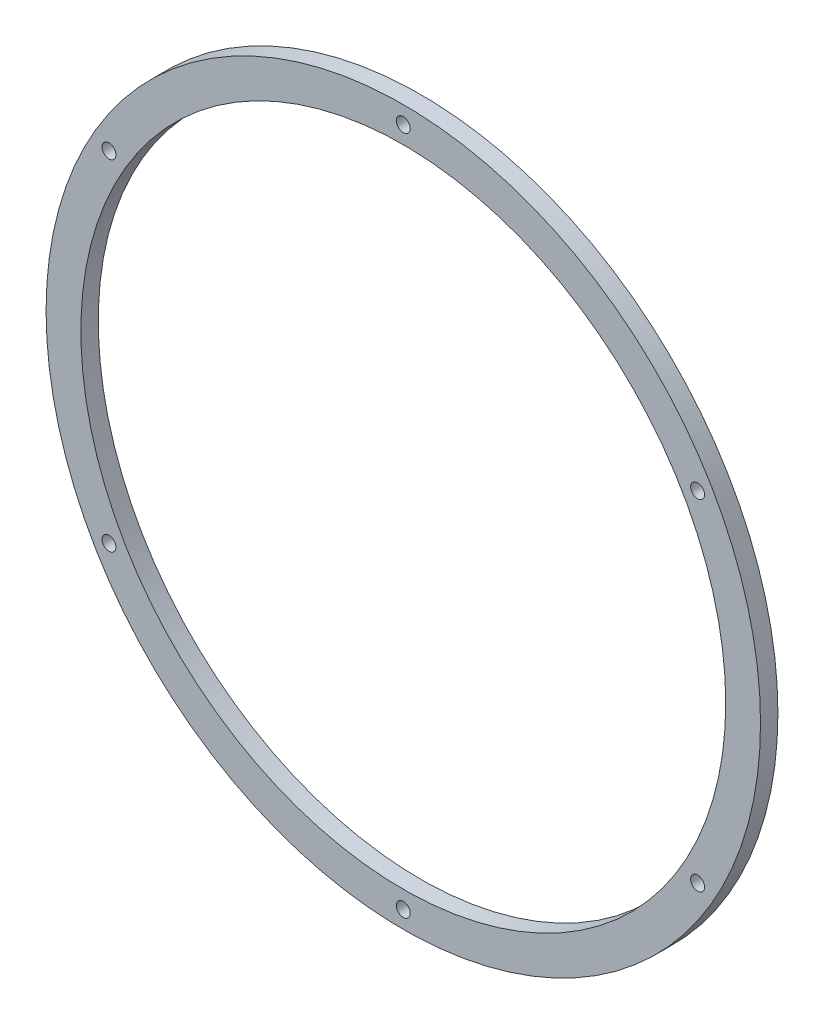
ISO-10303-21;
HEADER;
FILE_DESCRIPTION(('STEP AP214'),'2;1');
FILE_NAME('part.step','',(''),(''),'','','');
FILE_SCHEMA(('AUTOMOTIVE_DESIGN { 1 0 10303 214 1 1 1 1 }'));
ENDSEC;
DATA;
#1=APPLICATION_CONTEXT('core data for automotive mechanical design processes');
#2=APPLICATION_PROTOCOL_DEFINITION('international standard','automotive_design',2000,#1);
#3=PRODUCT_CONTEXT('',#1,'mechanical');
#4=PRODUCT('Part','Part','',(#3));
#5=PRODUCT_RELATED_PRODUCT_CATEGORY('part','',(#4));
#6=PRODUCT_DEFINITION_FORMATION('','',#4);
#7=PRODUCT_DEFINITION_CONTEXT('part definition',#1,'design');
#8=PRODUCT_DEFINITION('design','',#6,#7);
#9=PRODUCT_DEFINITION_SHAPE('','',#8);
#10=(LENGTH_UNIT() NAMED_UNIT(*) SI_UNIT(.MILLI.,.METRE.));
#11=(NAMED_UNIT(*) PLANE_ANGLE_UNIT() SI_UNIT($,.RADIAN.));
#12=(NAMED_UNIT(*) SI_UNIT($,.STERADIAN.) SOLID_ANGLE_UNIT());
#13=UNCERTAINTY_MEASURE_WITH_UNIT(LENGTH_MEASURE(1.E-05),#10,'distance_accuracy_value','');
#14=(GEOMETRIC_REPRESENTATION_CONTEXT(3) GLOBAL_UNCERTAINTY_ASSIGNED_CONTEXT((#13)) GLOBAL_UNIT_ASSIGNED_CONTEXT((#10,
#11,#12)) REPRESENTATION_CONTEXT('',''));
#15=CARTESIAN_POINT('',(0.,0.,0.));
#16=DIRECTION('',(0.,0.,1.));
#17=DIRECTION('',(1.,0.,0.));
#18=AXIS2_PLACEMENT_3D('',#15,#16,#17);
#19=CARTESIAN_POINT('',(0.,0.,5.));
#20=DIRECTION('',(0.,0.,1.));
#21=DIRECTION('',(1.,0.,0.));
#22=AXIS2_PLACEMENT_3D('',#19,#20,#21);
#23=PLANE('',#22);
#24=CARTESIAN_POINT('',(-169.221363899478,97.700000000002,5.));
#25=DIRECTION('',(0.,0.,1.));
#26=DIRECTION('',(0.50000000000001,0.866025403784433,0.));
#27=AXIS2_PLACEMENT_3D('',#24,#25,#26);
#28=CIRCLE('',#27,4.);
#29=CARTESIAN_POINT('',(-167.221363899478,101.16410161514,5.));
#30=VERTEX_POINT('',#29);
#31=EDGE_CURVE('E68',#30,#30,#28,.T.);
#32=ORIENTED_EDGE('',*,*,#31,.F.);
#33=EDGE_LOOP('',(#32));
#34=FACE_BOUND('',#33,.T.);
#35=CARTESIAN_POINT('',(-169.22136389948,-97.6999999999984,5.));
#36=DIRECTION('',(0.,0.,1.));
#37=DIRECTION('',(-0.499999999999992,0.866025403784443,0.));
#38=AXIS2_PLACEMENT_3D('',#35,#36,#37);
#39=CIRCLE('',#38,4.);
#40=CARTESIAN_POINT('',(-171.22136389948,-94.2358983848607,5.));
#41=VERTEX_POINT('',#40);
#42=EDGE_CURVE('E74',#41,#41,#39,.T.);
#43=ORIENTED_EDGE('',*,*,#42,.F.);
#44=EDGE_LOOP('',(#43));
#45=FACE_BOUND('',#44,.T.);
#46=CARTESIAN_POINT('',(0.,-195.4,5.));
#47=DIRECTION('',(0.,0.,1.));
#48=DIRECTION('',(-1.,0.,0.));
#49=AXIS2_PLACEMENT_3D('',#46,#47,#48);
#50=CIRCLE('',#49,4.);
#51=CARTESIAN_POINT('',(-4.,-195.4,5.));
#52=VERTEX_POINT('',#51);
#53=EDGE_CURVE('E80',#52,#52,#50,.T.);
#54=ORIENTED_EDGE('',*,*,#53,.F.);
#55=EDGE_LOOP('',(#54));
#56=FACE_BOUND('',#55,.T.);
#57=CARTESIAN_POINT('',(169.221363899479,-97.7000000000008,5.));
#58=DIRECTION('',(0.,0.,1.));
#59=DIRECTION('',(-0.500000000000004,-0.866025403784436,0.));
#60=AXIS2_PLACEMENT_3D('',#57,#58,#59);
#61=CIRCLE('',#60,4.);
#62=CARTESIAN_POINT('',(167.221363899479,-101.164101615139,5.));
#63=VERTEX_POINT('',#62);
#64=EDGE_CURVE('E86',#63,#63,#61,.T.);
#65=ORIENTED_EDGE('',*,*,#64,.F.);
#66=EDGE_LOOP('',(#65));
#67=FACE_BOUND('',#66,.T.);
#68=CARTESIAN_POINT('',(169.22136389948,97.6999999999996,5.));
#69=DIRECTION('',(0.,0.,1.));
#70=DIRECTION('',(0.499999999999998,-0.86602540378444,0.));
#71=AXIS2_PLACEMENT_3D('',#68,#69,#70);
#72=CIRCLE('',#71,4.);
#73=CARTESIAN_POINT('',(171.22136389948,94.2358983848619,5.));
#74=VERTEX_POINT('',#73);
#75=EDGE_CURVE('E62',#74,#74,#72,.T.);
#76=ORIENTED_EDGE('',*,*,#75,.F.);
#77=EDGE_LOOP('',(#76));
#78=FACE_BOUND('',#77,.T.);
#79=CARTESIAN_POINT('',(0.,195.4,5.));
#80=DIRECTION('',(0.,0.,1.));
#81=DIRECTION('',(1.,0.,0.));
#82=AXIS2_PLACEMENT_3D('',#79,#80,#81);
#83=CIRCLE('',#82,4.);
#84=CARTESIAN_POINT('',(4.,195.4,5.));
#85=VERTEX_POINT('',#84);
#86=EDGE_CURVE('E56',#85,#85,#83,.T.);
#87=ORIENTED_EDGE('',*,*,#86,.F.);
#88=EDGE_LOOP('',(#87));
#89=FACE_BOUND('',#88,.T.);
#90=CARTESIAN_POINT('',(0.,0.,5.));
#91=DIRECTION('',(0.,0.,1.));
#92=DIRECTION('',(1.,0.,0.));
#93=AXIS2_PLACEMENT_3D('',#90,#91,#92);
#94=CIRCLE('',#93,205.4);
#95=CARTESIAN_POINT('',(205.4,0.,5.));
#96=VERTEX_POINT('',#95);
#97=EDGE_CURVE('E10',#96,#96,#94,.T.);
#98=ORIENTED_EDGE('',*,*,#97,.T.);
#99=EDGE_LOOP('',(#98));
#100=FACE_BOUND('',#99,.T.);
#101=CARTESIAN_POINT('',(0.,0.,5.));
#102=DIRECTION('',(0.,0.,1.));
#103=DIRECTION('',(1.,0.,0.));
#104=AXIS2_PLACEMENT_3D('',#101,#102,#103);
#105=CIRCLE('',#104,185.4);
#106=CARTESIAN_POINT('',(185.4,0.,5.));
#107=VERTEX_POINT('',#106);
#108=EDGE_CURVE('E48',#107,#107,#105,.T.);
#109=ORIENTED_EDGE('',*,*,#108,.F.);
#110=EDGE_LOOP('',(#109));
#111=FACE_BOUND('',#110,.T.);
#112=ADVANCED_FACE('F37',(#34,#45,#56,#67,#78,#89,#100,#111),#23,.T.);
#113=CARTESIAN_POINT('',(0.,0.,-5.));
#114=DIRECTION('',(0.,0.,1.));
#115=DIRECTION('',(1.,0.,0.));
#116=AXIS2_PLACEMENT_3D('',#113,#114,#115);
#117=PLANE('',#116);
#118=CARTESIAN_POINT('',(-169.221363899478,97.700000000002,-5.));
#119=DIRECTION('',(0.,0.,1.));
#120=DIRECTION('',(0.50000000000001,0.866025403784433,0.));
#121=AXIS2_PLACEMENT_3D('',#118,#119,#120);
#122=CIRCLE('',#121,4.);
#123=CARTESIAN_POINT('',(-167.221363899478,101.16410161514,-5.));
#124=VERTEX_POINT('',#123);
#125=EDGE_CURVE('E71',#124,#124,#122,.T.);
#126=ORIENTED_EDGE('',*,*,#125,.T.);
#127=EDGE_LOOP('',(#126));
#128=FACE_BOUND('',#127,.T.);
#129=CARTESIAN_POINT('',(-169.22136389948,-97.6999999999984,-5.));
#130=DIRECTION('',(0.,0.,1.));
#131=DIRECTION('',(-0.499999999999992,0.866025403784443,0.));
#132=AXIS2_PLACEMENT_3D('',#129,#130,#131);
#133=CIRCLE('',#132,4.);
#134=CARTESIAN_POINT('',(-171.22136389948,-94.2358983848607,-5.));
#135=VERTEX_POINT('',#134);
#136=EDGE_CURVE('E77',#135,#135,#133,.T.);
#137=ORIENTED_EDGE('',*,*,#136,.T.);
#138=EDGE_LOOP('',(#137));
#139=FACE_BOUND('',#138,.T.);
#140=CARTESIAN_POINT('',(0.,-195.4,-5.));
#141=DIRECTION('',(0.,0.,1.));
#142=DIRECTION('',(-1.,0.,0.));
#143=AXIS2_PLACEMENT_3D('',#140,#141,#142);
#144=CIRCLE('',#143,4.);
#145=CARTESIAN_POINT('',(-4.,-195.4,-5.));
#146=VERTEX_POINT('',#145);
#147=EDGE_CURVE('E83',#146,#146,#144,.T.);
#148=ORIENTED_EDGE('',*,*,#147,.T.);
#149=EDGE_LOOP('',(#148));
#150=FACE_BOUND('',#149,.T.);
#151=CARTESIAN_POINT('',(169.221363899479,-97.7000000000008,-5.));
#152=DIRECTION('',(0.,0.,1.));
#153=DIRECTION('',(-0.500000000000004,-0.866025403784436,0.));
#154=AXIS2_PLACEMENT_3D('',#151,#152,#153);
#155=CIRCLE('',#154,4.);
#156=CARTESIAN_POINT('',(167.221363899479,-101.164101615139,-5.));
#157=VERTEX_POINT('',#156);
#158=EDGE_CURVE('E65',#157,#157,#155,.T.);
#159=ORIENTED_EDGE('',*,*,#158,.T.);
#160=EDGE_LOOP('',(#159));
#161=FACE_BOUND('',#160,.T.);
#162=CARTESIAN_POINT('',(169.22136389948,97.6999999999996,-5.));
#163=DIRECTION('',(0.,0.,1.));
#164=DIRECTION('',(0.499999999999998,-0.86602540378444,0.));
#165=AXIS2_PLACEMENT_3D('',#162,#163,#164);
#166=CIRCLE('',#165,4.);
#167=CARTESIAN_POINT('',(171.22136389948,94.2358983848619,-5.));
#168=VERTEX_POINT('',#167);
#169=EDGE_CURVE('E59',#168,#168,#166,.T.);
#170=ORIENTED_EDGE('',*,*,#169,.T.);
#171=EDGE_LOOP('',(#170));
#172=FACE_BOUND('',#171,.T.);
#173=CARTESIAN_POINT('',(0.,195.4,-5.));
#174=DIRECTION('',(0.,0.,1.));
#175=DIRECTION('',(1.,0.,0.));
#176=AXIS2_PLACEMENT_3D('',#173,#174,#175);
#177=CIRCLE('',#176,4.);
#178=CARTESIAN_POINT('',(4.,195.4,-5.));
#179=VERTEX_POINT('',#178);
#180=EDGE_CURVE('E53',#179,#179,#177,.T.);
#181=ORIENTED_EDGE('',*,*,#180,.T.);
#182=EDGE_LOOP('',(#181));
#183=FACE_BOUND('',#182,.T.);
#184=CARTESIAN_POINT('',(0.,0.,-5.));
#185=DIRECTION('',(0.,0.,1.));
#186=DIRECTION('',(1.,0.,0.));
#187=AXIS2_PLACEMENT_3D('',#184,#185,#186);
#188=CIRCLE('',#187,205.4);
#189=CARTESIAN_POINT('',(205.4,0.,-5.));
#190=VERTEX_POINT('',#189);
#191=EDGE_CURVE('E41',#190,#190,#188,.T.);
#192=ORIENTED_EDGE('',*,*,#191,.F.);
#193=EDGE_LOOP('',(#192));
#194=FACE_BOUND('',#193,.T.);
#195=CARTESIAN_POINT('',(0.,0.,-5.));
#196=DIRECTION('',(0.,0.,1.));
#197=DIRECTION('',(1.,0.,0.));
#198=AXIS2_PLACEMENT_3D('',#195,#196,#197);
#199=CIRCLE('',#198,185.4);
#200=CARTESIAN_POINT('',(185.4,0.,-5.));
#201=VERTEX_POINT('',#200);
#202=EDGE_CURVE('E50',#201,#201,#199,.T.);
#203=ORIENTED_EDGE('',*,*,#202,.T.);
#204=EDGE_LOOP('',(#203));
#205=FACE_BOUND('',#204,.T.);
#206=ADVANCED_FACE('F92',(#128,#139,#150,#161,#172,#183,#194,#205),#117,.F.);
#207=CARTESIAN_POINT('',(0.,0.,5.));
#208=DIRECTION('',(0.,0.,-1.));
#209=DIRECTION('',(-1.,0.,0.));
#210=AXIS2_PLACEMENT_3D('',#207,#208,#209);
#211=CYLINDRICAL_SURFACE('',#210,205.4);
#212=ORIENTED_EDGE('',*,*,#97,.F.);
#213=EDGE_LOOP('',(#212));
#214=FACE_BOUND('',#213,.T.);
#215=ORIENTED_EDGE('',*,*,#191,.T.);
#216=EDGE_LOOP('',(#215));
#217=FACE_BOUND('',#216,.T.);
#218=ADVANCED_FACE('F39',(#214,#217),#211,.T.);
#219=CARTESIAN_POINT('',(0.,0.,5.));
#220=DIRECTION('',(0.,0.,-1.));
#221=DIRECTION('',(-1.,0.,0.));
#222=AXIS2_PLACEMENT_3D('',#219,#220,#221);
#223=CYLINDRICAL_SURFACE('',#222,185.4);
#224=ORIENTED_EDGE('',*,*,#108,.T.);
#225=EDGE_LOOP('',(#224));
#226=FACE_BOUND('',#225,.T.);
#227=ORIENTED_EDGE('',*,*,#202,.F.);
#228=EDGE_LOOP('',(#227));
#229=FACE_BOUND('',#228,.T.);
#230=ADVANCED_FACE('F113',(#226,#229),#223,.F.);
#231=CARTESIAN_POINT('',(0.,195.4,-5.));
#232=DIRECTION('',(0.,0.,1.));
#233=DIRECTION('',(1.,0.,0.));
#234=AXIS2_PLACEMENT_3D('',#231,#232,#233);
#235=CYLINDRICAL_SURFACE('',#234,4.);
#236=ORIENTED_EDGE('',*,*,#180,.F.);
#237=EDGE_LOOP('',(#236));
#238=FACE_BOUND('',#237,.T.);
#239=ORIENTED_EDGE('',*,*,#86,.T.);
#240=EDGE_LOOP('',(#239));
#241=FACE_BOUND('',#240,.T.);
#242=ADVANCED_FACE('F116',(#238,#241),#235,.F.);
#243=CARTESIAN_POINT('',(169.22136389948,97.6999999999996,-5.));
#244=DIRECTION('',(0.,0.,1.));
#245=DIRECTION('',(1.,0.,0.));
#246=AXIS2_PLACEMENT_3D('',#243,#244,#245);
#247=CYLINDRICAL_SURFACE('',#246,4.);
#248=ORIENTED_EDGE('',*,*,#169,.F.);
#249=EDGE_LOOP('',(#248));
#250=FACE_BOUND('',#249,.T.);
#251=ORIENTED_EDGE('',*,*,#75,.T.);
#252=EDGE_LOOP('',(#251));
#253=FACE_BOUND('',#252,.T.);
#254=ADVANCED_FACE('F99',(#250,#253),#247,.F.);
#255=CARTESIAN_POINT('',(169.221363899479,-97.7000000000008,-5.));
#256=DIRECTION('',(0.,0.,1.));
#257=DIRECTION('',(1.,0.,0.));
#258=AXIS2_PLACEMENT_3D('',#255,#256,#257);
#259=CYLINDRICAL_SURFACE('',#258,4.);
#260=ORIENTED_EDGE('',*,*,#158,.F.);
#261=EDGE_LOOP('',(#260));
#262=FACE_BOUND('',#261,.T.);
#263=ORIENTED_EDGE('',*,*,#64,.T.);
#264=EDGE_LOOP('',(#263));
#265=FACE_BOUND('',#264,.T.);
#266=ADVANCED_FACE('F95',(#262,#265),#259,.F.);
#267=CARTESIAN_POINT('',(0.,-195.4,-5.));
#268=DIRECTION('',(0.,0.,1.));
#269=DIRECTION('',(1.,0.,0.));
#270=AXIS2_PLACEMENT_3D('',#267,#268,#269);
#271=CYLINDRICAL_SURFACE('',#270,4.);
#272=ORIENTED_EDGE('',*,*,#147,.F.);
#273=EDGE_LOOP('',(#272));
#274=FACE_BOUND('',#273,.T.);
#275=ORIENTED_EDGE('',*,*,#53,.T.);
#276=EDGE_LOOP('',(#275));
#277=FACE_BOUND('',#276,.T.);
#278=ADVANCED_FACE('F98',(#274,#277),#271,.F.);
#279=CARTESIAN_POINT('',(-169.22136389948,-97.6999999999984,-5.));
#280=DIRECTION('',(0.,0.,1.));
#281=DIRECTION('',(1.,0.,0.));
#282=AXIS2_PLACEMENT_3D('',#279,#280,#281);
#283=CYLINDRICAL_SURFACE('',#282,4.);
#284=ORIENTED_EDGE('',*,*,#136,.F.);
#285=EDGE_LOOP('',(#284));
#286=FACE_BOUND('',#285,.T.);
#287=ORIENTED_EDGE('',*,*,#42,.T.);
#288=EDGE_LOOP('',(#287));
#289=FACE_BOUND('',#288,.T.);
#290=ADVANCED_FACE('F137',(#286,#289),#283,.F.);
#291=CARTESIAN_POINT('',(-169.221363899478,97.700000000002,-5.));
#292=DIRECTION('',(0.,0.,1.));
#293=DIRECTION('',(1.,0.,0.));
#294=AXIS2_PLACEMENT_3D('',#291,#292,#293);
#295=CYLINDRICAL_SURFACE('',#294,4.);
#296=ORIENTED_EDGE('',*,*,#125,.F.);
#297=EDGE_LOOP('',(#296));
#298=FACE_BOUND('',#297,.T.);
#299=ORIENTED_EDGE('',*,*,#31,.T.);
#300=EDGE_LOOP('',(#299));
#301=FACE_BOUND('',#300,.T.);
#302=ADVANCED_FACE('F134',(#298,#301),#295,.F.);
#303=CLOSED_SHELL('',(#112,#206,#218,#230,#242,#254,#266,#278,#290,#302));
#304=MANIFOLD_SOLID_BREP('B2',#303);
#305=ADVANCED_BREP_SHAPE_REPRESENTATION('',(#18,#304),#14);
#306=SHAPE_DEFINITION_REPRESENTATION(#9,#305);
ENDSEC;
END-ISO-10303-21;
